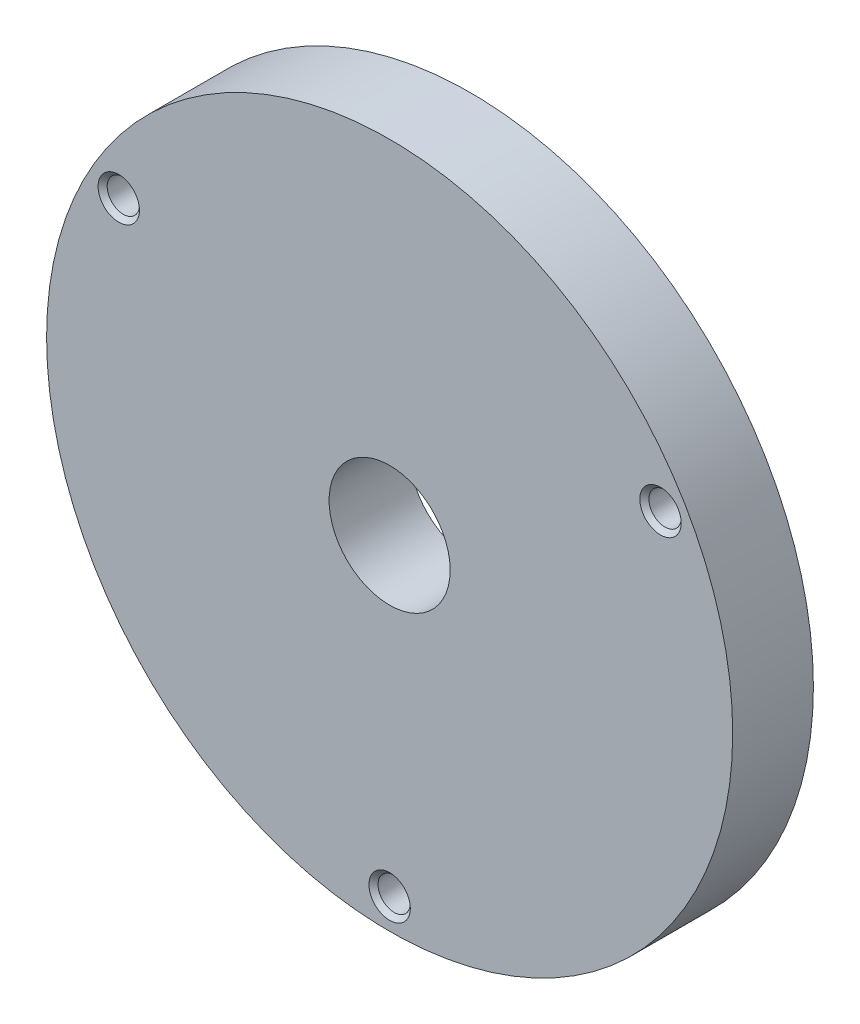
ISO-10303-21;
HEADER;
FILE_DESCRIPTION(('STEP AP214'),'2;1');
FILE_NAME('part.step','',(''),(''),'','','');
FILE_SCHEMA(('AUTOMOTIVE_DESIGN { 1 0 10303 214 1 1 1 1 }'));
ENDSEC;
DATA;
#1=APPLICATION_CONTEXT('core data for automotive mechanical design processes');
#2=APPLICATION_PROTOCOL_DEFINITION('international standard','automotive_design',2000,#1);
#3=PRODUCT_CONTEXT('',#1,'mechanical');
#4=PRODUCT('Part','Part','',(#3));
#5=PRODUCT_RELATED_PRODUCT_CATEGORY('part','',(#4));
#6=PRODUCT_DEFINITION_FORMATION('','',#4);
#7=PRODUCT_DEFINITION_CONTEXT('part definition',#1,'design');
#8=PRODUCT_DEFINITION('design','',#6,#7);
#9=PRODUCT_DEFINITION_SHAPE('','',#8);
#10=(LENGTH_UNIT() NAMED_UNIT(*) SI_UNIT(.MILLI.,.METRE.));
#11=(NAMED_UNIT(*) PLANE_ANGLE_UNIT() SI_UNIT($,.RADIAN.));
#12=(NAMED_UNIT(*) SI_UNIT($,.STERADIAN.) SOLID_ANGLE_UNIT());
#13=UNCERTAINTY_MEASURE_WITH_UNIT(LENGTH_MEASURE(1.E-05),#10,'distance_accuracy_value','');
#14=(GEOMETRIC_REPRESENTATION_CONTEXT(3) GLOBAL_UNCERTAINTY_ASSIGNED_CONTEXT((#13)) GLOBAL_UNIT_ASSIGNED_CONTEXT((#10,
#11,#12)) REPRESENTATION_CONTEXT('',''));
#15=CARTESIAN_POINT('',(0.,0.,0.));
#16=DIRECTION('',(0.,0.,1.));
#17=DIRECTION('',(1.,0.,0.));
#18=AXIS2_PLACEMENT_3D('',#15,#16,#17);
#19=CARTESIAN_POINT('',(0.,0.,-4.));
#20=DIRECTION('',(0.,0.,1.));
#21=DIRECTION('',(1.,0.,0.));
#22=AXIS2_PLACEMENT_3D('',#19,#20,#21);
#23=CYLINDRICAL_SURFACE('',#22,17.);
#24=CARTESIAN_POINT('',(0.,0.,-4.));
#25=DIRECTION('',(0.,0.,1.));
#26=DIRECTION('',(1.,0.,0.));
#27=AXIS2_PLACEMENT_3D('',#24,#25,#26);
#28=CIRCLE('',#27,17.);
#29=CARTESIAN_POINT('',(17.,0.,-4.));
#30=VERTEX_POINT('',#29);
#31=EDGE_CURVE('E10',#30,#30,#28,.T.);
#32=ORIENTED_EDGE('',*,*,#31,.T.);
#33=EDGE_LOOP('',(#32));
#34=FACE_BOUND('',#33,.T.);
#35=CARTESIAN_POINT('',(0.,0.,0.));
#36=DIRECTION('',(0.,0.,1.));
#37=DIRECTION('',(1.,0.,0.));
#38=AXIS2_PLACEMENT_3D('',#35,#36,#37);
#39=CIRCLE('',#38,17.);
#40=CARTESIAN_POINT('',(17.,0.,0.));
#41=VERTEX_POINT('',#40);
#42=EDGE_CURVE('E37',#41,#41,#39,.T.);
#43=ORIENTED_EDGE('',*,*,#42,.F.);
#44=EDGE_LOOP('',(#43));
#45=FACE_BOUND('',#44,.T.);
#46=ADVANCED_FACE('F34',(#34,#45),#23,.T.);
#47=CARTESIAN_POINT('',(0.,0.,-4.));
#48=DIRECTION('',(0.,0.,1.));
#49=DIRECTION('',(1.,0.,0.));
#50=AXIS2_PLACEMENT_3D('',#47,#48,#49);
#51=PLANE('',#50);
#52=CARTESIAN_POINT('',(0.,0.,-4.));
#53=DIRECTION('',(0.,0.,1.));
#54=DIRECTION('',(1.,0.,0.));
#55=AXIS2_PLACEMENT_3D('',#52,#53,#54);
#56=CIRCLE('',#55,3.);
#57=CARTESIAN_POINT('',(3.,0.,-4.));
#58=VERTEX_POINT('',#57);
#59=EDGE_CURVE('E72',#58,#58,#56,.T.);
#60=ORIENTED_EDGE('',*,*,#59,.T.);
#61=EDGE_LOOP('',(#60));
#62=FACE_BOUND('',#61,.T.);
#63=CARTESIAN_POINT('',(-13.4233937586589,7.74999999999987,-4.));
#64=DIRECTION('',(0.,0.,1.));
#65=DIRECTION('',(1.,0.,0.));
#66=AXIS2_PLACEMENT_3D('',#63,#64,#65);
#67=CIRCLE('',#66,0.799999999999986);
#68=CARTESIAN_POINT('',(-12.6233937586589,7.74999999999987,-4.));
#69=VERTEX_POINT('',#68);
#70=EDGE_CURVE('E63',#69,#69,#67,.T.);
#71=ORIENTED_EDGE('',*,*,#70,.T.);
#72=EDGE_LOOP('',(#71));
#73=FACE_BOUND('',#72,.T.);
#74=CARTESIAN_POINT('',(13.4233937586588,7.75000000000006,-4.));
#75=DIRECTION('',(0.,0.,1.));
#76=DIRECTION('',(1.,0.,0.));
#77=AXIS2_PLACEMENT_3D('',#74,#75,#76);
#78=CIRCLE('',#77,0.799999999999986);
#79=CARTESIAN_POINT('',(14.2233937586587,7.75000000000006,-4.));
#80=VERTEX_POINT('',#79);
#81=EDGE_CURVE('E54',#80,#80,#78,.T.);
#82=ORIENTED_EDGE('',*,*,#81,.T.);
#83=EDGE_LOOP('',(#82));
#84=FACE_BOUND('',#83,.T.);
#85=CARTESIAN_POINT('',(0.,-15.5,-4.));
#86=DIRECTION('',(0.,0.,1.));
#87=DIRECTION('',(1.,0.,0.));
#88=AXIS2_PLACEMENT_3D('',#85,#86,#87);
#89=CIRCLE('',#88,0.799999999999987);
#90=CARTESIAN_POINT('',(0.799999999999989,-15.5,-4.));
#91=VERTEX_POINT('',#90);
#92=EDGE_CURVE('E44',#91,#91,#89,.T.);
#93=ORIENTED_EDGE('',*,*,#92,.T.);
#94=EDGE_LOOP('',(#93));
#95=FACE_BOUND('',#94,.T.);
#96=ORIENTED_EDGE('',*,*,#31,.F.);
#97=EDGE_LOOP('',(#96));
#98=FACE_BOUND('',#97,.T.);
#99=ADVANCED_FACE('F79',(#62,#73,#84,#95,#98),#51,.F.);
#100=CARTESIAN_POINT('',(0.,0.,0.));
#101=DIRECTION('',(0.,0.,1.));
#102=DIRECTION('',(1.,0.,0.));
#103=AXIS2_PLACEMENT_3D('',#100,#101,#102);
#104=PLANE('',#103);
#105=CARTESIAN_POINT('',(0.,0.,0.));
#106=DIRECTION('',(0.,0.,1.));
#107=DIRECTION('',(1.,0.,0.));
#108=AXIS2_PLACEMENT_3D('',#105,#106,#107);
#109=CIRCLE('',#108,3.);
#110=CARTESIAN_POINT('',(3.,0.,0.));
#111=VERTEX_POINT('',#110);
#112=EDGE_CURVE('E73',#111,#111,#109,.T.);
#113=ORIENTED_EDGE('',*,*,#112,.F.);
#114=EDGE_LOOP('',(#113));
#115=FACE_BOUND('',#114,.T.);
#116=CARTESIAN_POINT('',(-13.4233937586589,7.74999999999987,0.));
#117=DIRECTION('',(0.,0.,1.));
#118=DIRECTION('',(1.,0.,0.));
#119=AXIS2_PLACEMENT_3D('',#116,#117,#118);
#120=CIRCLE('',#119,1.025);
#121=CARTESIAN_POINT('',(-12.3983937586589,7.74999999999987,0.));
#122=VERTEX_POINT('',#121);
#123=EDGE_CURVE('E69',#122,#122,#120,.T.);
#124=ORIENTED_EDGE('',*,*,#123,.F.);
#125=EDGE_LOOP('',(#124));
#126=FACE_BOUND('',#125,.T.);
#127=CARTESIAN_POINT('',(13.4233937586588,7.75000000000006,0.));
#128=DIRECTION('',(0.,0.,1.));
#129=DIRECTION('',(1.,0.,0.));
#130=AXIS2_PLACEMENT_3D('',#127,#128,#129);
#131=CIRCLE('',#130,1.025);
#132=CARTESIAN_POINT('',(14.4483937586588,7.75000000000006,0.));
#133=VERTEX_POINT('',#132);
#134=EDGE_CURVE('E60',#133,#133,#131,.T.);
#135=ORIENTED_EDGE('',*,*,#134,.F.);
#136=EDGE_LOOP('',(#135));
#137=FACE_BOUND('',#136,.T.);
#138=CARTESIAN_POINT('',(0.,-15.5,0.));
#139=DIRECTION('',(0.,0.,1.));
#140=DIRECTION('',(1.,0.,0.));
#141=AXIS2_PLACEMENT_3D('',#138,#139,#140);
#142=CIRCLE('',#141,1.025);
#143=CARTESIAN_POINT('',(1.025,-15.5,0.));
#144=VERTEX_POINT('',#143);
#145=EDGE_CURVE('E51',#144,#144,#142,.T.);
#146=ORIENTED_EDGE('',*,*,#145,.F.);
#147=EDGE_LOOP('',(#146));
#148=FACE_BOUND('',#147,.T.);
#149=ORIENTED_EDGE('',*,*,#42,.T.);
#150=EDGE_LOOP('',(#149));
#151=FACE_BOUND('',#150,.T.);
#152=ADVANCED_FACE('F89',(#115,#126,#137,#148,#151),#104,.T.);
#153=CARTESIAN_POINT('',(0.,-15.5,0.));
#154=DIRECTION('',(0.,0.,1.));
#155=DIRECTION('',(1.,0.,0.));
#156=AXIS2_PLACEMENT_3D('',#153,#154,#155);
#157=CYLINDRICAL_SURFACE('',#156,0.799999999999993);
#158=ORIENTED_EDGE('',*,*,#92,.F.);
#159=EDGE_LOOP('',(#158));
#160=FACE_BOUND('',#159,.T.);
#161=CARTESIAN_POINT('',(0.,-15.5,-0.225));
#162=DIRECTION('',(0.,0.,1.));
#163=DIRECTION('',(1.,0.,0.));
#164=AXIS2_PLACEMENT_3D('',#161,#162,#163);
#165=CIRCLE('',#164,0.799999999999999);
#166=CARTESIAN_POINT('',(0.800000000000001,-15.5,-0.225));
#167=VERTEX_POINT('',#166);
#168=EDGE_CURVE('E48',#167,#167,#165,.T.);
#169=ORIENTED_EDGE('',*,*,#168,.T.);
#170=EDGE_LOOP('',(#169));
#171=FACE_BOUND('',#170,.T.);
#172=ADVANCED_FACE('F92',(#160,#171),#157,.F.);
#173=CARTESIAN_POINT('',(0.,-15.5,0.));
#174=DIRECTION('',(0.,0.,1.));
#175=DIRECTION('',(1.,0.,0.));
#176=AXIS2_PLACEMENT_3D('',#173,#174,#175);
#177=CONICAL_SURFACE('',#176,1.025,0.785398163397445);
#178=ORIENTED_EDGE('',*,*,#168,.F.);
#179=EDGE_LOOP('',(#178));
#180=FACE_BOUND('',#179,.T.);
#181=ORIENTED_EDGE('',*,*,#145,.T.);
#182=EDGE_LOOP('',(#181));
#183=FACE_BOUND('',#182,.T.);
#184=ADVANCED_FACE('F111',(#180,#183),#177,.F.);
#185=CARTESIAN_POINT('',(13.4233937586588,7.75000000000006,0.));
#186=DIRECTION('',(0.,0.,1.));
#187=DIRECTION('',(1.,0.,0.));
#188=AXIS2_PLACEMENT_3D('',#185,#186,#187);
#189=CYLINDRICAL_SURFACE('',#188,0.799999999999993);
#190=ORIENTED_EDGE('',*,*,#81,.F.);
#191=EDGE_LOOP('',(#190));
#192=FACE_BOUND('',#191,.T.);
#193=CARTESIAN_POINT('',(13.4233937586588,7.75000000000006,-0.225));
#194=DIRECTION('',(0.,0.,1.));
#195=DIRECTION('',(1.,0.,0.));
#196=AXIS2_PLACEMENT_3D('',#193,#194,#195);
#197=CIRCLE('',#196,0.799999999999999);
#198=CARTESIAN_POINT('',(14.2233937586588,7.75000000000006,-0.225));
#199=VERTEX_POINT('',#198);
#200=EDGE_CURVE('E57',#199,#199,#197,.T.);
#201=ORIENTED_EDGE('',*,*,#200,.T.);
#202=EDGE_LOOP('',(#201));
#203=FACE_BOUND('',#202,.T.);
#204=ADVANCED_FACE('F115',(#192,#203),#189,.F.);
#205=CARTESIAN_POINT('',(13.4233937586588,7.75000000000006,0.));
#206=DIRECTION('',(0.,0.,1.));
#207=DIRECTION('',(1.,0.,0.));
#208=AXIS2_PLACEMENT_3D('',#205,#206,#207);
#209=CONICAL_SURFACE('',#208,1.025,0.785398163397446);
#210=ORIENTED_EDGE('',*,*,#200,.F.);
#211=EDGE_LOOP('',(#210));
#212=FACE_BOUND('',#211,.T.);
#213=ORIENTED_EDGE('',*,*,#134,.T.);
#214=EDGE_LOOP('',(#213));
#215=FACE_BOUND('',#214,.T.);
#216=ADVANCED_FACE('F119',(#212,#215),#209,.F.);
#217=CARTESIAN_POINT('',(-13.4233937586589,7.74999999999987,0.));
#218=DIRECTION('',(0.,0.,1.));
#219=DIRECTION('',(1.,0.,0.));
#220=AXIS2_PLACEMENT_3D('',#217,#218,#219);
#221=CYLINDRICAL_SURFACE('',#220,0.799999999999993);
#222=ORIENTED_EDGE('',*,*,#70,.F.);
#223=EDGE_LOOP('',(#222));
#224=FACE_BOUND('',#223,.T.);
#225=CARTESIAN_POINT('',(-13.4233937586589,7.74999999999987,-0.225));
#226=DIRECTION('',(0.,0.,1.));
#227=DIRECTION('',(1.,0.,0.));
#228=AXIS2_PLACEMENT_3D('',#225,#226,#227);
#229=CIRCLE('',#228,0.799999999999999);
#230=CARTESIAN_POINT('',(-12.6233937586589,7.74999999999987,-0.225));
#231=VERTEX_POINT('',#230);
#232=EDGE_CURVE('E66',#231,#231,#229,.T.);
#233=ORIENTED_EDGE('',*,*,#232,.T.);
#234=EDGE_LOOP('',(#233));
#235=FACE_BOUND('',#234,.T.);
#236=ADVANCED_FACE('F123',(#224,#235),#221,.F.);
#237=CARTESIAN_POINT('',(-13.4233937586589,7.74999999999987,0.));
#238=DIRECTION('',(0.,0.,1.));
#239=DIRECTION('',(1.,0.,0.));
#240=AXIS2_PLACEMENT_3D('',#237,#238,#239);
#241=CONICAL_SURFACE('',#240,1.025,0.785398163397446);
#242=ORIENTED_EDGE('',*,*,#232,.F.);
#243=EDGE_LOOP('',(#242));
#244=FACE_BOUND('',#243,.T.);
#245=ORIENTED_EDGE('',*,*,#123,.T.);
#246=EDGE_LOOP('',(#245));
#247=FACE_BOUND('',#246,.T.);
#248=ADVANCED_FACE('F85',(#244,#247),#241,.F.);
#249=CARTESIAN_POINT('',(0.,0.,-4.));
#250=DIRECTION('',(0.,0.,1.));
#251=DIRECTION('',(1.,0.,0.));
#252=AXIS2_PLACEMENT_3D('',#249,#250,#251);
#253=CYLINDRICAL_SURFACE('',#252,3.);
#254=ORIENTED_EDGE('',*,*,#59,.F.);
#255=EDGE_LOOP('',(#254));
#256=FACE_BOUND('',#255,.T.);
#257=ORIENTED_EDGE('',*,*,#112,.T.);
#258=EDGE_LOOP('',(#257));
#259=FACE_BOUND('',#258,.T.);
#260=ADVANCED_FACE('F82',(#256,#259),#253,.F.);
#261=CLOSED_SHELL('',(#46,#99,#152,#172,#184,#204,#216,#236,#248,#260));
#262=MANIFOLD_SOLID_BREP('B2',#261);
#263=ADVANCED_BREP_SHAPE_REPRESENTATION('',(#18,#262),#14);
#264=SHAPE_DEFINITION_REPRESENTATION(#9,#263);
ENDSEC;
END-ISO-10303-21;
